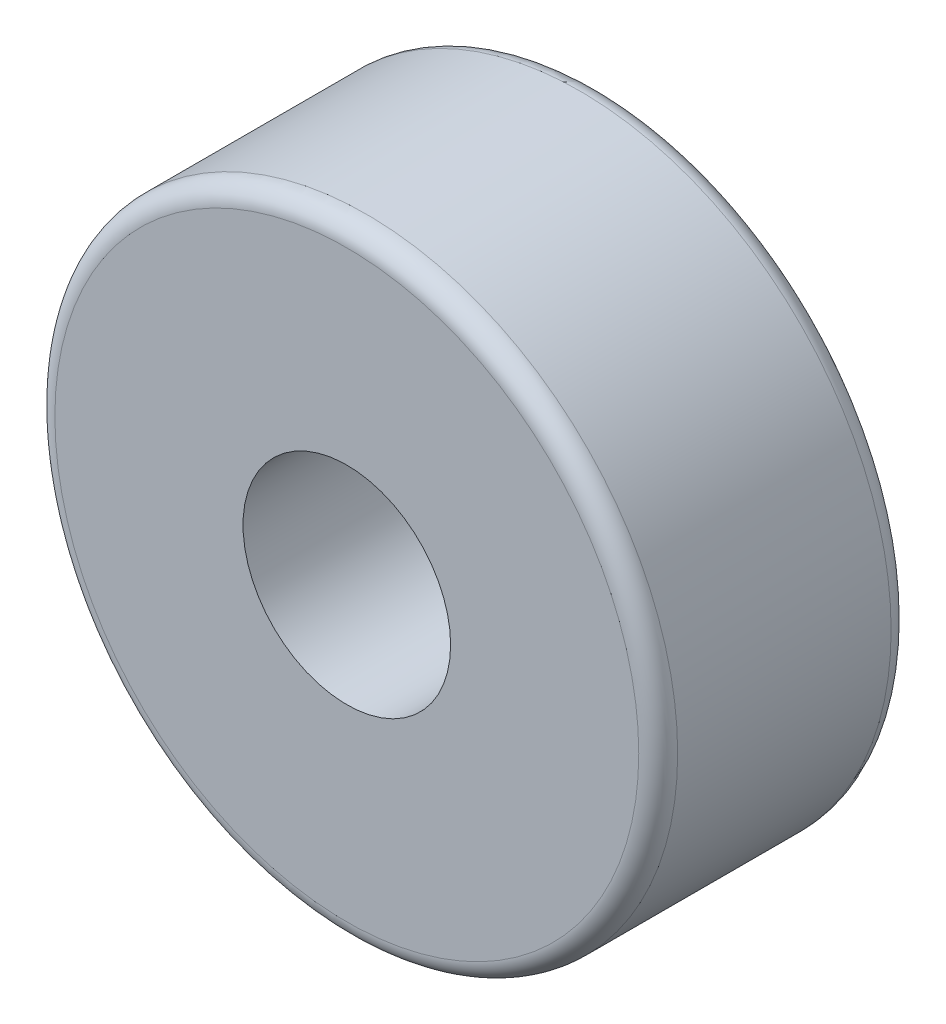
ISO-10303-21;
HEADER;
FILE_DESCRIPTION(('STEP AP214'),'2;1');
FILE_NAME('part.step','',(''),(''),'','','');
FILE_SCHEMA(('AUTOMOTIVE_DESIGN { 1 0 10303 214 1 1 1 1 }'));
ENDSEC;
DATA;
#1=APPLICATION_CONTEXT('core data for automotive mechanical design processes');
#2=APPLICATION_PROTOCOL_DEFINITION('international standard','automotive_design',2000,#1);
#3=PRODUCT_CONTEXT('',#1,'mechanical');
#4=PRODUCT('Part','Part','',(#3));
#5=PRODUCT_RELATED_PRODUCT_CATEGORY('part','',(#4));
#6=PRODUCT_DEFINITION_FORMATION('','',#4);
#7=PRODUCT_DEFINITION_CONTEXT('part definition',#1,'design');
#8=PRODUCT_DEFINITION('design','',#6,#7);
#9=PRODUCT_DEFINITION_SHAPE('','',#8);
#10=(LENGTH_UNIT() NAMED_UNIT(*) SI_UNIT(.MILLI.,.METRE.));
#11=(NAMED_UNIT(*) PLANE_ANGLE_UNIT() SI_UNIT($,.RADIAN.));
#12=(NAMED_UNIT(*) SI_UNIT($,.STERADIAN.) SOLID_ANGLE_UNIT());
#13=UNCERTAINTY_MEASURE_WITH_UNIT(LENGTH_MEASURE(1.E-05),#10,'distance_accuracy_value','');
#14=(GEOMETRIC_REPRESENTATION_CONTEXT(3) GLOBAL_UNCERTAINTY_ASSIGNED_CONTEXT((#13)) GLOBAL_UNIT_ASSIGNED_CONTEXT((#10,
#11,#12)) REPRESENTATION_CONTEXT('',''));
#15=CARTESIAN_POINT('',(0.,0.,0.));
#16=DIRECTION('',(0.,0.,1.));
#17=DIRECTION('',(1.,0.,0.));
#18=AXIS2_PLACEMENT_3D('',#15,#16,#17);
#19=CARTESIAN_POINT('',(0.,0.,30.8769125375625));
#20=DIRECTION('',(0.,0.,1.));
#21=DIRECTION('',(1.,0.,0.));
#22=AXIS2_PLACEMENT_3D('',#19,#20,#21);
#23=PLANE('',#22);
#24=CARTESIAN_POINT('',(0.,0.,30.8769125375625));
#25=DIRECTION('',(0.,0.,1.));
#26=DIRECTION('',(1.,0.,0.));
#27=AXIS2_PLACEMENT_3D('',#24,#25,#26);
#28=CIRCLE('',#27,35.72);
#29=CARTESIAN_POINT('',(35.72,0.,30.8769125375625));
#30=VERTEX_POINT('',#29);
#31=EDGE_CURVE('E11',#30,#30,#28,.T.);
#32=ORIENTED_EDGE('',*,*,#31,.T.);
#33=EDGE_LOOP('',(#32));
#34=FACE_BOUND('',#33,.T.);
#35=CARTESIAN_POINT('',(0.,0.,30.8769125375625));
#36=DIRECTION('',(0.,0.,1.));
#37=DIRECTION('',(1.,0.,0.));
#38=AXIS2_PLACEMENT_3D('',#35,#36,#37);
#39=CIRCLE('',#38,12.7);
#40=CARTESIAN_POINT('',(12.7,0.,30.8769125375625));
#41=VERTEX_POINT('',#40);
#42=EDGE_CURVE('E71',#41,#41,#39,.T.);
#43=ORIENTED_EDGE('',*,*,#42,.F.);
#44=EDGE_LOOP('',(#43));
#45=FACE_BOUND('',#44,.T.);
#46=ADVANCED_FACE('F46',(#34,#45),#23,.T.);
#47=CARTESIAN_POINT('',(0.,0.,0.));
#48=DIRECTION('',(0.,0.,1.));
#49=DIRECTION('',(1.,0.,0.));
#50=AXIS2_PLACEMENT_3D('',#47,#48,#49);
#51=PLANE('',#50);
#52=CARTESIAN_POINT('',(0.,0.,0.));
#53=DIRECTION('',(0.,0.,1.));
#54=DIRECTION('',(1.,0.,0.));
#55=AXIS2_PLACEMENT_3D('',#52,#53,#54);
#56=CIRCLE('',#55,35.72);
#57=CARTESIAN_POINT('',(35.72,0.,0.));
#58=VERTEX_POINT('',#57);
#59=EDGE_CURVE('E54',#58,#58,#56,.F.);
#60=ORIENTED_EDGE('',*,*,#59,.T.);
#61=EDGE_LOOP('',(#60));
#62=FACE_BOUND('',#61,.T.);
#63=CARTESIAN_POINT('',(0.,0.,0.));
#64=DIRECTION('',(0.,0.,1.));
#65=DIRECTION('',(1.,0.,0.));
#66=AXIS2_PLACEMENT_3D('',#63,#64,#65);
#67=CIRCLE('',#66,12.7);
#68=CARTESIAN_POINT('',(12.7,0.,0.));
#69=VERTEX_POINT('',#68);
#70=EDGE_CURVE('E72',#69,#69,#67,.T.);
#71=ORIENTED_EDGE('',*,*,#70,.T.);
#72=EDGE_LOOP('',(#71));
#73=FACE_BOUND('',#72,.T.);
#74=ADVANCED_FACE('F83',(#62,#73),#51,.F.);
#75=CARTESIAN_POINT('',(0.,0.,30.8769125375625));
#76=DIRECTION('',(0.,0.,-1.));
#77=DIRECTION('',(-1.,0.,0.));
#78=AXIS2_PLACEMENT_3D('',#75,#76,#77);
#79=CYLINDRICAL_SURFACE('',#78,38.1);
#80=CARTESIAN_POINT('',(0.,0.,2.38));
#81=DIRECTION('',(0.,0.,1.));
#82=DIRECTION('',(1.,0.,0.));
#83=AXIS2_PLACEMENT_3D('',#80,#81,#82);
#84=CIRCLE('',#83,38.1);
#85=CARTESIAN_POINT('',(38.1,0.,2.38));
#86=VERTEX_POINT('',#85);
#87=EDGE_CURVE('E60',#86,#86,#84,.T.);
#88=ORIENTED_EDGE('',*,*,#87,.T.);
#89=EDGE_LOOP('',(#88));
#90=FACE_BOUND('',#89,.T.);
#91=CARTESIAN_POINT('',(0.,0.,28.4969125375625));
#92=DIRECTION('',(0.,0.,1.));
#93=DIRECTION('',(1.,0.,0.));
#94=AXIS2_PLACEMENT_3D('',#91,#92,#93);
#95=CIRCLE('',#94,38.1);
#96=CARTESIAN_POINT('',(38.1,0.,28.4969125375625));
#97=VERTEX_POINT('',#96);
#98=EDGE_CURVE('E66',#97,#97,#95,.F.);
#99=ORIENTED_EDGE('',*,*,#98,.T.);
#100=EDGE_LOOP('',(#99));
#101=FACE_BOUND('',#100,.T.);
#102=ADVANCED_FACE('F88',(#90,#101),#79,.T.);
#103=CARTESIAN_POINT('',(0.,0.,30.8769125375625));
#104=DIRECTION('',(0.,0.,-1.));
#105=DIRECTION('',(-1.,0.,0.));
#106=AXIS2_PLACEMENT_3D('',#103,#104,#105);
#107=CYLINDRICAL_SURFACE('',#106,12.7);
#108=ORIENTED_EDGE('',*,*,#42,.T.);
#109=EDGE_LOOP('',(#108));
#110=FACE_BOUND('',#109,.T.);
#111=ORIENTED_EDGE('',*,*,#70,.F.);
#112=EDGE_LOOP('',(#111));
#113=FACE_BOUND('',#112,.T.);
#114=ADVANCED_FACE('F79',(#110,#113),#107,.F.);
#115=CARTESIAN_POINT('',(0.,0.,2.38));
#116=DIRECTION('',(0.,0.,1.));
#117=DIRECTION('',(1.,0.,0.));
#118=AXIS2_PLACEMENT_3D('',#115,#116,#117);
#119=TOROIDAL_SURFACE('',#118,35.72,2.38);
#120=ORIENTED_EDGE('',*,*,#59,.F.);
#121=EDGE_LOOP('',(#120));
#122=FACE_BOUND('',#121,.T.);
#123=ORIENTED_EDGE('',*,*,#87,.F.);
#124=EDGE_LOOP('',(#123));
#125=FACE_BOUND('',#124,.T.);
#126=ADVANCED_FACE('F94',(#122,#125),#119,.T.);
#127=CARTESIAN_POINT('',(0.,0.,28.4969125375625));
#128=DIRECTION('',(0.,0.,1.));
#129=DIRECTION('',(1.,0.,0.));
#130=AXIS2_PLACEMENT_3D('',#127,#128,#129);
#131=TOROIDAL_SURFACE('',#130,35.72,2.38);
#132=ORIENTED_EDGE('',*,*,#98,.F.);
#133=EDGE_LOOP('',(#132));
#134=FACE_BOUND('',#133,.T.);
#135=ORIENTED_EDGE('',*,*,#31,.F.);
#136=EDGE_LOOP('',(#135));
#137=FACE_BOUND('',#136,.T.);
#138=ADVANCED_FACE('F48',(#134,#137),#131,.T.);
#139=CLOSED_SHELL('',(#46,#74,#102,#114,#126,#138));
#140=MANIFOLD_SOLID_BREP('B2',#139);
#141=ADVANCED_BREP_SHAPE_REPRESENTATION('',(#18,#140),#14);
#142=SHAPE_DEFINITION_REPRESENTATION(#9,#141);
ENDSEC;
END-ISO-10303-21;
